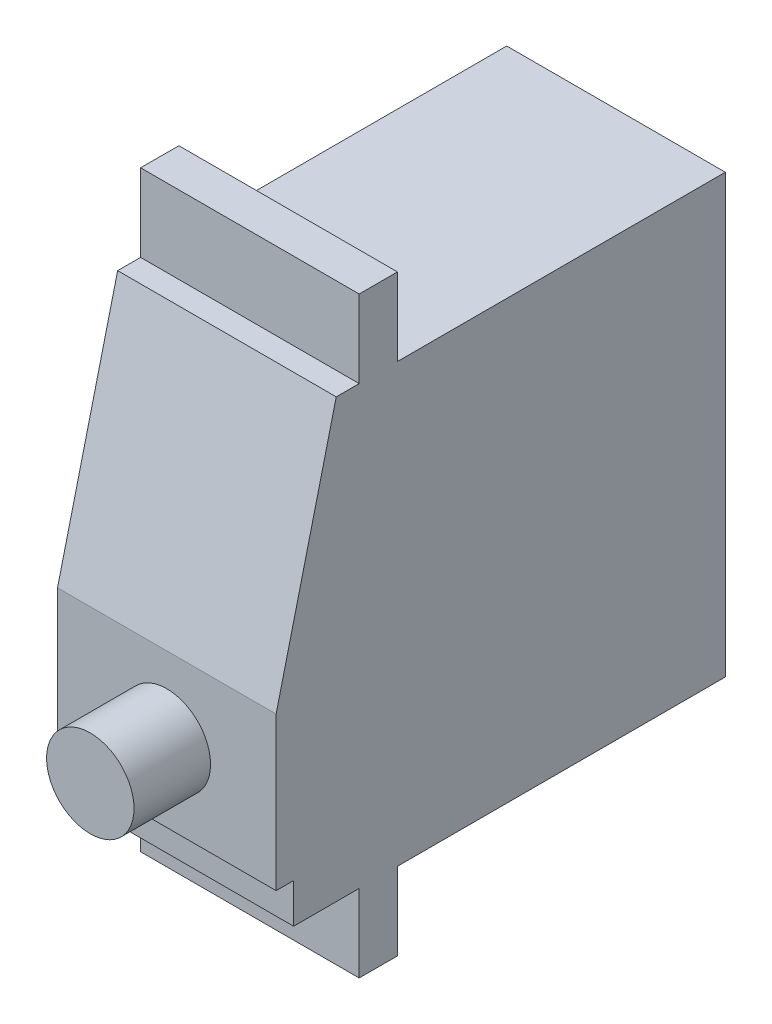
ISO-10303-21;
HEADER;
FILE_DESCRIPTION(('STEP AP214'),'2;1');
FILE_NAME('part.step','',(''),(''),'','','');
FILE_SCHEMA(('AUTOMOTIVE_DESIGN { 1 0 10303 214 1 1 1 1 }'));
ENDSEC;
DATA;
#1=APPLICATION_CONTEXT('core data for automotive mechanical design processes');
#2=APPLICATION_PROTOCOL_DEFINITION('international standard','automotive_design',2000,#1);
#3=PRODUCT_CONTEXT('',#1,'mechanical');
#4=PRODUCT('Part','Part','',(#3));
#5=PRODUCT_RELATED_PRODUCT_CATEGORY('part','',(#4));
#6=PRODUCT_DEFINITION_FORMATION('','',#4);
#7=PRODUCT_DEFINITION_CONTEXT('part definition',#1,'design');
#8=PRODUCT_DEFINITION('design','',#6,#7);
#9=PRODUCT_DEFINITION_SHAPE('','',#8);
#10=(LENGTH_UNIT() NAMED_UNIT(*) SI_UNIT(.MILLI.,.METRE.));
#11=(NAMED_UNIT(*) PLANE_ANGLE_UNIT() SI_UNIT($,.RADIAN.));
#12=(NAMED_UNIT(*) SI_UNIT($,.STERADIAN.) SOLID_ANGLE_UNIT());
#13=UNCERTAINTY_MEASURE_WITH_UNIT(LENGTH_MEASURE(1.E-05),#10,'distance_accuracy_value','');
#14=(GEOMETRIC_REPRESENTATION_CONTEXT(3) GLOBAL_UNCERTAINTY_ASSIGNED_CONTEXT((#13)) GLOBAL_UNIT_ASSIGNED_CONTEXT((#10,
#11,#12)) REPRESENTATION_CONTEXT('',''));
#15=CARTESIAN_POINT('',(0.,0.,0.));
#16=DIRECTION('',(0.,0.,1.));
#17=DIRECTION('',(1.,0.,0.));
#18=AXIS2_PLACEMENT_3D('',#15,#16,#17);
#19=CARTESIAN_POINT('',(-9.99999955296516,29.3791089206934,0.));
#20=DIRECTION('',(0.,1.,0.));
#21=DIRECTION('',(0.,0.,1.));
#22=AXIS2_PLACEMENT_3D('',#19,#20,#21);
#23=PLANE('',#22);
#24=DIRECTION('',(0.,0.,1.));
#25=VECTOR('',#24,1.);
#26=CARTESIAN_POINT('',(-9.99999955296516,29.3791089206934,0.));
#27=LINE('',#26,#25);
#28=CARTESIAN_POINT('',(-9.99999955296516,29.3791089206934,0.));
#29=VERTEX_POINT('',#28);
#30=CARTESIAN_POINT('',(-9.99999955296518,29.3791089206934,32.225966149538));
#31=VERTEX_POINT('',#30);
#32=EDGE_CURVE('E170',#29,#31,#27,.T.);
#33=ORIENTED_EDGE('',*,*,#32,.T.);
#34=DIRECTION('',(0.00392855270652036,0.,-0.999992283207042));
#35=VECTOR('',#34,1.);
#36=CARTESIAN_POINT('',(-10.0051267672293,29.3791089206934,33.5310713833168));
#37=LINE('',#36,#35);
#38=CARTESIAN_POINT('',(-9.99125465750694,29.3791089206934,29.9999993294477));
#39=VERTEX_POINT('',#38);
#40=EDGE_CURVE('E153',#31,#39,#37,.T.);
#41=ORIENTED_EDGE('',*,*,#40,.T.);
#42=DIRECTION('',(1.,0.,0.));
#43=VECTOR('',#42,1.);
#44=CARTESIAN_POINT('',(-17.9139704070891,29.3791089206934,29.9999993294477));
#45=LINE('',#44,#43);
#46=CARTESIAN_POINT('',(10.,29.3791089206934,29.9999993294477));
#47=VERTEX_POINT('',#46);
#48=EDGE_CURVE('E159',#39,#47,#45,.T.);
#49=ORIENTED_EDGE('',*,*,#48,.T.);
#50=DIRECTION('',(0.,0.,1.));
#51=VECTOR('',#50,1.);
#52=CARTESIAN_POINT('',(10.,29.3791089206934,0.));
#53=LINE('',#52,#51);
#54=CARTESIAN_POINT('',(10.,29.3791089206934,0.));
#55=VERTEX_POINT('',#54);
#56=EDGE_CURVE('E234',#55,#47,#53,.T.);
#57=ORIENTED_EDGE('',*,*,#56,.F.);
#58=DIRECTION('',(1.,0.,0.));
#59=VECTOR('',#58,1.);
#60=CARTESIAN_POINT('',(-9.99999955296516,29.3791089206934,0.));
#61=LINE('',#60,#59);
#62=EDGE_CURVE('E239',#29,#55,#61,.T.);
#63=ORIENTED_EDGE('',*,*,#62,.F.);
#64=EDGE_LOOP('',(#33,#41,#49,#57,#63));
#65=FACE_BOUND('',#64,.T.);
#66=ADVANCED_FACE('F35',(#65),#23,.T.);
#67=CARTESIAN_POINT('',(-9.99999955296516,-17.720889300108,0.));
#68=DIRECTION('',(0.,0.,-1.));
#69=DIRECTION('',(0.,1.,0.));
#70=AXIS2_PLACEMENT_3D('',#67,#68,#69);
#71=PLANE('',#70);
#72=DIRECTION('',(1.,0.,0.));
#73=VECTOR('',#72,1.);
#74=CARTESIAN_POINT('',(-9.99999955296516,-10.6208901852369,0.));
#75=LINE('',#74,#73);
#76=CARTESIAN_POINT('',(-9.99999955296516,-10.6208901852369,0.));
#77=VERTEX_POINT('',#76);
#78=CARTESIAN_POINT('',(10.,-10.6208901852369,0.));
#79=VERTEX_POINT('',#78);
#80=EDGE_CURVE('E256',#77,#79,#75,.T.);
#81=ORIENTED_EDGE('',*,*,#80,.F.);
#82=DIRECTION('',(0.,1.,0.));
#83=VECTOR('',#82,1.);
#84=CARTESIAN_POINT('',(-9.99999955296516,-17.720889300108,0.));
#85=LINE('',#84,#83);
#86=EDGE_CURVE('E232',#77,#29,#85,.T.);
#87=ORIENTED_EDGE('',*,*,#86,.T.);
#88=ORIENTED_EDGE('',*,*,#62,.T.);
#89=DIRECTION('',(0.,1.,0.));
#90=VECTOR('',#89,1.);
#91=CARTESIAN_POINT('',(10.,-17.720889300108,0.));
#92=LINE('',#91,#90);
#93=EDGE_CURVE('E254',#79,#55,#92,.T.);
#94=ORIENTED_EDGE('',*,*,#93,.F.);
#95=EDGE_LOOP('',(#81,#87,#88,#94));
#96=FACE_BOUND('',#95,.T.);
#97=ADVANCED_FACE('F334',(#96),#71,.T.);
#98=CARTESIAN_POINT('',(-9.99999955296516,-17.720889300108,41.0999990999699));
#99=DIRECTION('',(0.,-1.,0.));
#100=DIRECTION('',(0.,0.,-1.));
#101=AXIS2_PLACEMENT_3D('',#98,#99,#100);
#102=PLANE('',#101);
#103=DIRECTION('',(1.,0.,0.));
#104=VECTOR('',#103,1.);
#105=CARTESIAN_POINT('',(-9.99999955296516,-17.720889300108,33.500000834465));
#106=LINE('',#105,#104);
#107=CARTESIAN_POINT('',(-9.99999955296516,-17.720889300108,33.500000834465));
#108=VERTEX_POINT('',#107);
#109=CARTESIAN_POINT('',(10.,-17.720889300108,33.500000834465));
#110=VERTEX_POINT('',#109);
#111=EDGE_CURVE('E290',#108,#110,#106,.T.);
#112=ORIENTED_EDGE('',*,*,#111,.F.);
#113=DIRECTION('',(0.,0.,-1.));
#114=VECTOR('',#113,1.);
#115=CARTESIAN_POINT('',(-9.99999955296516,-17.720889300108,41.0999990999699));
#116=LINE('',#115,#114);
#117=CARTESIAN_POINT('',(-9.99999955296516,-17.720889300108,29.9999993294477));
#118=VERTEX_POINT('',#117);
#119=EDGE_CURVE('E241',#108,#118,#116,.T.);
#120=ORIENTED_EDGE('',*,*,#119,.T.);
#121=DIRECTION('',(1.,0.,0.));
#122=VECTOR('',#121,1.);
#123=CARTESIAN_POINT('',(-9.99999955296516,-17.720889300108,29.9999993294477));
#124=LINE('',#123,#122);
#125=CARTESIAN_POINT('',(10.,-17.720889300108,29.9999993294477));
#126=VERTEX_POINT('',#125);
#127=EDGE_CURVE('E307',#118,#126,#124,.T.);
#128=ORIENTED_EDGE('',*,*,#127,.T.);
#129=DIRECTION('',(0.,0.,-1.));
#130=VECTOR('',#129,1.);
#131=CARTESIAN_POINT('',(10.,-17.720889300108,41.0999990999699));
#132=LINE('',#131,#130);
#133=EDGE_CURVE('E230',#110,#126,#132,.T.);
#134=ORIENTED_EDGE('',*,*,#133,.F.);
#135=EDGE_LOOP('',(#112,#120,#128,#134));
#136=FACE_BOUND('',#135,.T.);
#137=ADVANCED_FACE('F207',(#136),#102,.T.);
#138=CARTESIAN_POINT('',(-9.99999955296516,7.00000021606684,41.0999990999699));
#139=DIRECTION('',(0.,0.,1.));
#140=DIRECTION('',(1.,0.,0.));
#141=AXIS2_PLACEMENT_3D('',#138,#139,#140);
#142=PLANE('',#141);
#143=CARTESIAN_POINT('',(0.,0.,41.0999990999699));
#144=DIRECTION('',(0.,0.,1.));
#145=DIRECTION('',(1.,0.,0.));
#146=AXIS2_PLACEMENT_3D('',#143,#144,#145);
#147=CIRCLE('',#146,4.);
#148=CARTESIAN_POINT('',(4.,0.,41.0999990999699));
#149=VERTEX_POINT('',#148);
#150=EDGE_CURVE('E12',#149,#149,#147,.T.);
#151=ORIENTED_EDGE('',*,*,#150,.F.);
#152=EDGE_LOOP('',(#151));
#153=FACE_BOUND('',#152,.T.);
#154=DIRECTION('',(1.,0.,0.));
#155=VECTOR('',#154,1.);
#156=CARTESIAN_POINT('',(-9.99999955296516,-7.00000021606684,41.0999990999699));
#157=LINE('',#156,#155);
#158=CARTESIAN_POINT('',(-9.99999955296516,-7.00000021606684,41.0999990999699));
#159=VERTEX_POINT('',#158);
#160=CARTESIAN_POINT('',(10.,-7.00000021606684,41.0999990999699));
#161=VERTEX_POINT('',#160);
#162=EDGE_CURVE('E212',#159,#161,#157,.T.);
#163=ORIENTED_EDGE('',*,*,#162,.T.);
#164=DIRECTION('',(0.,-1.,0.));
#165=VECTOR('',#164,1.);
#166=CARTESIAN_POINT('',(10.,7.00000021606684,41.0999990999699));
#167=LINE('',#166,#165);
#168=CARTESIAN_POINT('',(10.,7.00000021606684,41.0999990999699));
#169=VERTEX_POINT('',#168);
#170=EDGE_CURVE('E214',#169,#161,#167,.T.);
#171=ORIENTED_EDGE('',*,*,#170,.F.);
#172=DIRECTION('',(1.,0.,0.));
#173=VECTOR('',#172,1.);
#174=CARTESIAN_POINT('',(-9.99999955296516,7.00000021606684,41.0999990999699));
#175=LINE('',#174,#173);
#176=CARTESIAN_POINT('',(-9.99999955296516,7.00000021606684,41.0999990999699));
#177=VERTEX_POINT('',#176);
#178=EDGE_CURVE('E171',#177,#169,#175,.T.);
#179=ORIENTED_EDGE('',*,*,#178,.F.);
#180=DIRECTION('',(0.,-1.,0.));
#181=VECTOR('',#180,1.);
#182=CARTESIAN_POINT('',(-9.99999955296516,7.00000021606684,41.0999990999699));
#183=LINE('',#182,#181);
#184=EDGE_CURVE('E217',#177,#159,#183,.T.);
#185=ORIENTED_EDGE('',*,*,#184,.T.);
#186=EDGE_LOOP('',(#163,#171,#179,#185));
#187=FACE_BOUND('',#186,.T.);
#188=ADVANCED_FACE('F203',(#153,#187),#142,.T.);
#189=CARTESIAN_POINT('',(-9.99999955296516,29.3791089206934,35.5999991297722));
#190=DIRECTION('',(0.,0.23866292569632,0.971102470338776));
#191=DIRECTION('',(0.,-0.971102470338776,0.23866292569632));
#192=AXIS2_PLACEMENT_3D('',#189,#190,#191);
#193=PLANE('',#192);
#194=DIRECTION('',(0.,-0.971102470338776,0.23866292569632));
#195=VECTOR('',#194,1.);
#196=CARTESIAN_POINT('',(10.,29.3791089206934,35.5999991297722));
#197=LINE('',#196,#195);
#198=CARTESIAN_POINT('',(10.,29.3791089206934,35.5999991297722));
#199=VERTEX_POINT('',#198);
#200=EDGE_CURVE('E229',#199,#169,#197,.T.);
#201=ORIENTED_EDGE('',*,*,#200,.F.);
#202=DIRECTION('',(1.,0.,0.));
#203=VECTOR('',#202,1.);
#204=CARTESIAN_POINT('',(-9.99999955296516,29.3791089206934,35.5999991297722));
#205=LINE('',#204,#203);
#206=CARTESIAN_POINT('',(-9.99999955296516,29.3791089206934,35.5999991297722));
#207=VERTEX_POINT('',#206);
#208=EDGE_CURVE('E175',#207,#199,#205,.T.);
#209=ORIENTED_EDGE('',*,*,#208,.F.);
#210=DIRECTION('',(0.,-0.971102470338776,0.23866292569632));
#211=VECTOR('',#210,1.);
#212=CARTESIAN_POINT('',(-9.99999955296516,29.3791089206934,35.5999991297722));
#213=LINE('',#212,#211);
#214=EDGE_CURVE('E250',#207,#177,#213,.T.);
#215=ORIENTED_EDGE('',*,*,#214,.T.);
#216=ORIENTED_EDGE('',*,*,#178,.T.);
#217=EDGE_LOOP('',(#201,#209,#215,#216));
#218=FACE_BOUND('',#217,.T.);
#219=ADVANCED_FACE('F206',(#218),#193,.T.);
#220=DIRECTION('',(1.,0.,0.));
#221=VECTOR('',#220,1.);
#222=CARTESIAN_POINT('',(-17.9139704070891,29.3791089206934,33.500000834465));
#223=LINE('',#222,#221);
#224=CARTESIAN_POINT('',(-9.99999955296516,29.3791089206934,33.500000834465));
#225=VERTEX_POINT('',#224);
#226=CARTESIAN_POINT('',(10.,29.3791089206934,33.500000834465));
#227=VERTEX_POINT('',#226);
#228=EDGE_CURVE('E44',#225,#227,#223,.T.);
#229=ORIENTED_EDGE('',*,*,#228,.F.);
#230=EDGE_CURVE('E262',#225,#207,#27,.T.);
#231=ORIENTED_EDGE('',*,*,#230,.T.);
#232=ORIENTED_EDGE('',*,*,#208,.T.);
#233=EDGE_CURVE('E255',#227,#199,#53,.T.);
#234=ORIENTED_EDGE('',*,*,#233,.F.);
#235=EDGE_LOOP('',(#229,#231,#232,#234));
#236=FACE_BOUND('',#235,.T.);
#237=ADVANCED_FACE('F260',(#236),#23,.T.);
#238=CARTESIAN_POINT('',(-9.99999955296516,0.,0.));
#239=DIRECTION('',(1.,0.,0.));
#240=DIRECTION('',(0.,0.,-1.));
#241=AXIS2_PLACEMENT_3D('',#238,#239,#240);
#242=PLANE('',#241);
#243=DIRECTION('',(0.,0.,1.));
#244=VECTOR('',#243,1.);
#245=CARTESIAN_POINT('',(-9.99999955296516,-10.6208901852369,33.500000834465));
#246=LINE('',#245,#244);
#247=CARTESIAN_POINT('',(-9.99999955296516,-10.6208901852369,33.500000834465));
#248=VERTEX_POINT('',#247);
#249=CARTESIAN_POINT('',(-9.99999955296516,-10.6208901852369,39.5000018179417));
#250=VERTEX_POINT('',#249);
#251=EDGE_CURVE('E283',#248,#250,#246,.T.);
#252=ORIENTED_EDGE('',*,*,#251,.T.);
#253=DIRECTION('',(0.,1.,0.));
#254=VECTOR('',#253,1.);
#255=CARTESIAN_POINT('',(-9.99999955296516,-10.6208901852369,39.5000018179417));
#256=LINE('',#255,#254);
#257=CARTESIAN_POINT('',(-9.99999955296516,-7.00000021606684,39.5000018179417));
#258=VERTEX_POINT('',#257);
#259=EDGE_CURVE('E60',#250,#258,#256,.T.);
#260=ORIENTED_EDGE('',*,*,#259,.T.);
#261=DIRECTION('',(0.,0.,1.));
#262=VECTOR('',#261,1.);
#263=CARTESIAN_POINT('',(-9.99999955296516,-7.00000021606684,39.5000018179417));
#264=LINE('',#263,#262);
#265=EDGE_CURVE('E269',#258,#159,#264,.T.);
#266=ORIENTED_EDGE('',*,*,#265,.T.);
#267=ORIENTED_EDGE('',*,*,#184,.F.);
#268=ORIENTED_EDGE('',*,*,#214,.F.);
#269=ORIENTED_EDGE('',*,*,#230,.F.);
#270=EDGE_CURVE('E312',#31,#225,#27,.T.);
#271=ORIENTED_EDGE('',*,*,#270,.F.);
#272=ORIENTED_EDGE('',*,*,#32,.F.);
#273=ORIENTED_EDGE('',*,*,#86,.F.);
#274=DIRECTION('',(0.,0.,1.));
#275=VECTOR('',#274,1.);
#276=CARTESIAN_POINT('',(-9.99999955296516,-10.6208901852369,0.));
#277=LINE('',#276,#275);
#278=CARTESIAN_POINT('',(-9.99999955296516,-10.6208901852369,29.9999993294477));
#279=VERTEX_POINT('',#278);
#280=EDGE_CURVE('E295',#77,#279,#277,.T.);
#281=ORIENTED_EDGE('',*,*,#280,.T.);
#282=DIRECTION('',(0.,-1.,0.));
#283=VECTOR('',#282,1.);
#284=CARTESIAN_POINT('',(-9.99999955296516,-10.6208901852369,29.9999993294477));
#285=LINE('',#284,#283);
#286=EDGE_CURVE('E298',#279,#118,#285,.T.);
#287=ORIENTED_EDGE('',*,*,#286,.T.);
#288=ORIENTED_EDGE('',*,*,#119,.F.);
#289=DIRECTION('',(0.,1.,0.));
#290=VECTOR('',#289,1.);
#291=CARTESIAN_POINT('',(-9.99999955296516,-17.720889300108,33.500000834465));
#292=LINE('',#291,#290);
#293=EDGE_CURVE('E280',#108,#248,#292,.T.);
#294=ORIENTED_EDGE('',*,*,#293,.T.);
#295=EDGE_LOOP('',(#252,#260,#266,#267,#268,#269,#271,#272,#273,#281,#287,#288,#294));
#296=FACE_BOUND('',#295,.T.);
#297=ADVANCED_FACE('F268',(#296),#242,.F.);
#298=CARTESIAN_POINT('',(10.,0.,0.));
#299=DIRECTION('',(1.,0.,0.));
#300=DIRECTION('',(0.,0.,-1.));
#301=AXIS2_PLACEMENT_3D('',#298,#299,#300);
#302=PLANE('',#301);
#303=DIRECTION('',(0.,1.,0.));
#304=VECTOR('',#303,1.);
#305=CARTESIAN_POINT('',(10.,-10.6208901852369,39.5000018179417));
#306=LINE('',#305,#304);
#307=CARTESIAN_POINT('',(10.,-10.6208901852369,39.5000018179417));
#308=VERTEX_POINT('',#307);
#309=CARTESIAN_POINT('',(10.,-7.00000021606684,39.5000018179417));
#310=VERTEX_POINT('',#309);
#311=EDGE_CURVE('E274',#308,#310,#306,.T.);
#312=ORIENTED_EDGE('',*,*,#311,.F.);
#313=DIRECTION('',(0.,0.,1.));
#314=VECTOR('',#313,1.);
#315=CARTESIAN_POINT('',(10.,-10.6208901852369,33.500000834465));
#316=LINE('',#315,#314);
#317=CARTESIAN_POINT('',(10.,-10.6208901852369,33.500000834465));
#318=VERTEX_POINT('',#317);
#319=EDGE_CURVE('E284',#318,#308,#316,.T.);
#320=ORIENTED_EDGE('',*,*,#319,.F.);
#321=DIRECTION('',(0.,1.,0.));
#322=VECTOR('',#321,1.);
#323=CARTESIAN_POINT('',(10.,-17.720889300108,33.500000834465));
#324=LINE('',#323,#322);
#325=EDGE_CURVE('E278',#110,#318,#324,.T.);
#326=ORIENTED_EDGE('',*,*,#325,.F.);
#327=ORIENTED_EDGE('',*,*,#133,.T.);
#328=DIRECTION('',(0.,-1.,0.));
#329=VECTOR('',#328,1.);
#330=CARTESIAN_POINT('',(10.,-10.6208901852369,29.9999993294477));
#331=LINE('',#330,#329);
#332=CARTESIAN_POINT('',(10.,-10.6208901852369,29.9999993294477));
#333=VERTEX_POINT('',#332);
#334=EDGE_CURVE('E299',#333,#126,#331,.T.);
#335=ORIENTED_EDGE('',*,*,#334,.F.);
#336=DIRECTION('',(0.,0.,1.));
#337=VECTOR('',#336,1.);
#338=CARTESIAN_POINT('',(10.,-10.6208901852369,0.));
#339=LINE('',#338,#337);
#340=EDGE_CURVE('E292',#79,#333,#339,.T.);
#341=ORIENTED_EDGE('',*,*,#340,.F.);
#342=ORIENTED_EDGE('',*,*,#93,.T.);
#343=ORIENTED_EDGE('',*,*,#56,.T.);
#344=DIRECTION('',(0.,1.,0.));
#345=VECTOR('',#344,1.);
#346=CARTESIAN_POINT('',(10.,29.3791089206934,29.9999993294477));
#347=LINE('',#346,#345);
#348=CARTESIAN_POINT('',(10.,36.4791117608547,29.9999993294477));
#349=VERTEX_POINT('',#348);
#350=EDGE_CURVE('E52',#47,#349,#347,.T.);
#351=ORIENTED_EDGE('',*,*,#350,.T.);
#352=DIRECTION('',(0.,0.,1.));
#353=VECTOR('',#352,1.);
#354=CARTESIAN_POINT('',(10.,36.4791117608547,29.9999993294477));
#355=LINE('',#354,#353);
#356=CARTESIAN_POINT('',(10.,36.4791117608547,33.500000834465));
#357=VERTEX_POINT('',#356);
#358=EDGE_CURVE('E179',#349,#357,#355,.T.);
#359=ORIENTED_EDGE('',*,*,#358,.T.);
#360=DIRECTION('',(0.,-1.,0.));
#361=VECTOR('',#360,1.);
#362=CARTESIAN_POINT('',(10.,36.4791117608547,33.500000834465));
#363=LINE('',#362,#361);
#364=EDGE_CURVE('E188',#357,#227,#363,.T.);
#365=ORIENTED_EDGE('',*,*,#364,.T.);
#366=ORIENTED_EDGE('',*,*,#233,.T.);
#367=ORIENTED_EDGE('',*,*,#200,.T.);
#368=ORIENTED_EDGE('',*,*,#170,.T.);
#369=DIRECTION('',(0.,0.,1.));
#370=VECTOR('',#369,1.);
#371=CARTESIAN_POINT('',(10.,-7.00000021606684,39.5000018179417));
#372=LINE('',#371,#370);
#373=EDGE_CURVE('E227',#310,#161,#372,.T.);
#374=ORIENTED_EDGE('',*,*,#373,.F.);
#375=EDGE_LOOP('',(#312,#320,#326,#327,#335,#341,#342,#343,#351,#359,#365,#366,#367,#368,#374));
#376=FACE_BOUND('',#375,.T.);
#377=ADVANCED_FACE('F226',(#376),#302,.T.);
#378=CARTESIAN_POINT('',(-9.99999955296516,-10.6208901852369,0.));
#379=DIRECTION('',(0.,1.,0.));
#380=DIRECTION('',(0.,0.,1.));
#381=AXIS2_PLACEMENT_3D('',#378,#379,#380);
#382=PLANE('',#381);
#383=ORIENTED_EDGE('',*,*,#340,.T.);
#384=DIRECTION('',(1.,0.,0.));
#385=VECTOR('',#384,1.);
#386=CARTESIAN_POINT('',(-9.99999955296516,-10.6208901852369,29.9999993294477));
#387=LINE('',#386,#385);
#388=EDGE_CURVE('E302',#279,#333,#387,.T.);
#389=ORIENTED_EDGE('',*,*,#388,.F.);
#390=ORIENTED_EDGE('',*,*,#280,.F.);
#391=ORIENTED_EDGE('',*,*,#80,.T.);
#392=EDGE_LOOP('',(#383,#389,#390,#391));
#393=FACE_BOUND('',#392,.T.);
#394=ADVANCED_FACE('F352',(#393),#382,.F.);
#395=CARTESIAN_POINT('',(-9.99999955296516,-10.6208901852369,29.9999993294477));
#396=DIRECTION('',(0.,0.,1.));
#397=DIRECTION('',(1.,0.,0.));
#398=AXIS2_PLACEMENT_3D('',#395,#396,#397);
#399=PLANE('',#398);
#400=ORIENTED_EDGE('',*,*,#334,.T.);
#401=ORIENTED_EDGE('',*,*,#127,.F.);
#402=ORIENTED_EDGE('',*,*,#286,.F.);
#403=ORIENTED_EDGE('',*,*,#388,.T.);
#404=EDGE_LOOP('',(#400,#401,#402,#403));
#405=FACE_BOUND('',#404,.T.);
#406=ADVANCED_FACE('F356',(#405),#399,.F.);
#407=CARTESIAN_POINT('',(-9.99999955296516,-17.720889300108,33.500000834465));
#408=DIRECTION('',(0.,0.,-1.));
#409=DIRECTION('',(-1.,0.,0.));
#410=AXIS2_PLACEMENT_3D('',#407,#408,#409);
#411=PLANE('',#410);
#412=ORIENTED_EDGE('',*,*,#325,.T.);
#413=DIRECTION('',(1.,0.,0.));
#414=VECTOR('',#413,1.);
#415=CARTESIAN_POINT('',(-9.99999955296516,-10.6208901852369,33.500000834465));
#416=LINE('',#415,#414);
#417=EDGE_CURVE('E286',#248,#318,#416,.T.);
#418=ORIENTED_EDGE('',*,*,#417,.F.);
#419=ORIENTED_EDGE('',*,*,#293,.F.);
#420=ORIENTED_EDGE('',*,*,#111,.T.);
#421=EDGE_LOOP('',(#412,#418,#419,#420));
#422=FACE_BOUND('',#421,.T.);
#423=ADVANCED_FACE('F360',(#422),#411,.F.);
#424=CARTESIAN_POINT('',(-9.99999955296516,-10.6208901852369,33.500000834465));
#425=DIRECTION('',(0.,1.,0.));
#426=DIRECTION('',(0.,0.,1.));
#427=AXIS2_PLACEMENT_3D('',#424,#425,#426);
#428=PLANE('',#427);
#429=ORIENTED_EDGE('',*,*,#319,.T.);
#430=DIRECTION('',(1.,0.,0.));
#431=VECTOR('',#430,1.);
#432=CARTESIAN_POINT('',(-9.99999955296516,-10.6208901852369,39.5000018179417));
#433=LINE('',#432,#431);
#434=EDGE_CURVE('E221',#250,#308,#433,.T.);
#435=ORIENTED_EDGE('',*,*,#434,.F.);
#436=ORIENTED_EDGE('',*,*,#251,.F.);
#437=ORIENTED_EDGE('',*,*,#417,.T.);
#438=EDGE_LOOP('',(#429,#435,#436,#437));
#439=FACE_BOUND('',#438,.T.);
#440=ADVANCED_FACE('F364',(#439),#428,.F.);
#441=CARTESIAN_POINT('',(-9.99999955296516,-10.6208901852369,39.5000018179417));
#442=DIRECTION('',(0.,0.,-1.));
#443=DIRECTION('',(-1.,0.,0.));
#444=AXIS2_PLACEMENT_3D('',#441,#442,#443);
#445=PLANE('',#444);
#446=ORIENTED_EDGE('',*,*,#311,.T.);
#447=DIRECTION('',(1.,0.,0.));
#448=VECTOR('',#447,1.);
#449=CARTESIAN_POINT('',(-9.99999955296516,-7.00000021606684,39.5000018179417));
#450=LINE('',#449,#448);
#451=EDGE_CURVE('E222',#258,#310,#450,.T.);
#452=ORIENTED_EDGE('',*,*,#451,.F.);
#453=ORIENTED_EDGE('',*,*,#259,.F.);
#454=ORIENTED_EDGE('',*,*,#434,.T.);
#455=EDGE_LOOP('',(#446,#452,#453,#454));
#456=FACE_BOUND('',#455,.T.);
#457=ADVANCED_FACE('F368',(#456),#445,.F.);
#458=CARTESIAN_POINT('',(-9.99999955296516,-7.00000021606684,39.5000018179417));
#459=DIRECTION('',(0.,1.,0.));
#460=DIRECTION('',(0.,0.,1.));
#461=AXIS2_PLACEMENT_3D('',#458,#459,#460);
#462=PLANE('',#461);
#463=ORIENTED_EDGE('',*,*,#373,.T.);
#464=ORIENTED_EDGE('',*,*,#162,.F.);
#465=ORIENTED_EDGE('',*,*,#265,.F.);
#466=ORIENTED_EDGE('',*,*,#451,.T.);
#467=EDGE_LOOP('',(#463,#464,#465,#466));
#468=FACE_BOUND('',#467,.T.);
#469=ADVANCED_FACE('F372',(#468),#462,.F.);
#470=CARTESIAN_POINT('',(-9.87324478812824,0.,-0.0387878618524385));
#471=DIRECTION('',(-0.999992283207042,0.,-0.00392855270652036));
#472=DIRECTION('',(-0.00392855270652036,0.,0.999992283207042));
#473=AXIS2_PLACEMENT_3D('',#470,#471,#472);
#474=PLANE('',#473);
#475=DIRECTION('',(0.,-1.,0.));
#476=VECTOR('',#475,1.);
#477=CARTESIAN_POINT('',(-10.0050047039986,36.4791117608547,33.500000834465));
#478=LINE('',#477,#476);
#479=CARTESIAN_POINT('',(-10.0050047039986,36.4791117608547,33.500000834465));
#480=VERTEX_POINT('',#479);
#481=CARTESIAN_POINT('',(-10.0050047039986,29.3791089206934,33.500000834465));
#482=VERTEX_POINT('',#481);
#483=EDGE_CURVE('E318',#480,#482,#478,.T.);
#484=ORIENTED_EDGE('',*,*,#483,.F.);
#485=DIRECTION('',(-0.00392855270652036,0.,0.999992283207042));
#486=VECTOR('',#485,1.);
#487=CARTESIAN_POINT('',(-9.99137693294937,36.4791117608547,30.0311238956651));
#488=LINE('',#487,#486);
#489=CARTESIAN_POINT('',(-9.99125465750694,36.4791117608547,29.9999993294477));
#490=VERTEX_POINT('',#489);
#491=EDGE_CURVE('E156',#490,#480,#488,.T.);
#492=ORIENTED_EDGE('',*,*,#491,.F.);
#493=DIRECTION('',(0.,1.,0.));
#494=VECTOR('',#493,1.);
#495=CARTESIAN_POINT('',(-9.99125465750694,29.3791089206934,29.9999993294477));
#496=LINE('',#495,#494);
#497=EDGE_CURVE('E150',#39,#490,#496,.T.);
#498=ORIENTED_EDGE('',*,*,#497,.F.);
#499=ORIENTED_EDGE('',*,*,#40,.F.);
#500=EDGE_CURVE('E165',#482,#31,#37,.T.);
#501=ORIENTED_EDGE('',*,*,#500,.F.);
#502=EDGE_LOOP('',(#484,#492,#498,#499,#501));
#503=FACE_BOUND('',#502,.T.);
#504=ADVANCED_FACE('F151',(#503),#474,.T.);
#505=CARTESIAN_POINT('',(-17.9139704070891,29.3791089206934,33.500000834465));
#506=DIRECTION('',(0.,-1.,0.));
#507=DIRECTION('',(0.,0.,-1.));
#508=AXIS2_PLACEMENT_3D('',#505,#506,#507);
#509=PLANE('',#508);
#510=ORIENTED_EDGE('',*,*,#500,.T.);
#511=ORIENTED_EDGE('',*,*,#270,.T.);
#512=EDGE_CURVE('E174',#482,#225,#223,.T.);
#513=ORIENTED_EDGE('',*,*,#512,.F.);
#514=EDGE_LOOP('',(#510,#511,#513));
#515=FACE_BOUND('',#514,.T.);
#516=ADVANCED_FACE('F314',(#515),#509,.T.);
#517=CARTESIAN_POINT('',(-17.9139704070891,29.3791089206934,29.9999993294477));
#518=DIRECTION('',(0.,0.,-1.));
#519=DIRECTION('',(-1.,0.,0.));
#520=AXIS2_PLACEMENT_3D('',#517,#518,#519);
#521=PLANE('',#520);
#522=ORIENTED_EDGE('',*,*,#48,.F.);
#523=ORIENTED_EDGE('',*,*,#497,.T.);
#524=DIRECTION('',(1.,0.,0.));
#525=VECTOR('',#524,1.);
#526=CARTESIAN_POINT('',(-17.9139704070891,36.4791117608547,29.9999993294477));
#527=LINE('',#526,#525);
#528=EDGE_CURVE('E158',#490,#349,#527,.T.);
#529=ORIENTED_EDGE('',*,*,#528,.T.);
#530=ORIENTED_EDGE('',*,*,#350,.F.);
#531=EDGE_LOOP('',(#522,#523,#529,#530));
#532=FACE_BOUND('',#531,.T.);
#533=ADVANCED_FACE('F161',(#532),#521,.T.);
#534=CARTESIAN_POINT('',(-17.9139704070891,36.4791117608547,29.9999993294477));
#535=DIRECTION('',(0.,1.,0.));
#536=DIRECTION('',(0.,0.,1.));
#537=AXIS2_PLACEMENT_3D('',#534,#535,#536);
#538=PLANE('',#537);
#539=ORIENTED_EDGE('',*,*,#528,.F.);
#540=ORIENTED_EDGE('',*,*,#491,.T.);
#541=DIRECTION('',(1.,0.,0.));
#542=VECTOR('',#541,1.);
#543=CARTESIAN_POINT('',(-17.9139704070891,36.4791117608547,33.500000834465));
#544=LINE('',#543,#542);
#545=EDGE_CURVE('E319',#480,#357,#544,.T.);
#546=ORIENTED_EDGE('',*,*,#545,.T.);
#547=ORIENTED_EDGE('',*,*,#358,.F.);
#548=EDGE_LOOP('',(#539,#540,#546,#547));
#549=FACE_BOUND('',#548,.T.);
#550=ADVANCED_FACE('F324',(#549),#538,.T.);
#551=CARTESIAN_POINT('',(-17.9139704070891,36.4791117608547,33.500000834465));
#552=DIRECTION('',(0.,0.,1.));
#553=DIRECTION('',(1.,0.,0.));
#554=AXIS2_PLACEMENT_3D('',#551,#552,#553);
#555=PLANE('',#554);
#556=ORIENTED_EDGE('',*,*,#545,.F.);
#557=ORIENTED_EDGE('',*,*,#483,.T.);
#558=ORIENTED_EDGE('',*,*,#512,.T.);
#559=ORIENTED_EDGE('',*,*,#228,.T.);
#560=ORIENTED_EDGE('',*,*,#364,.F.);
#561=EDGE_LOOP('',(#556,#557,#558,#559,#560));
#562=FACE_BOUND('',#561,.T.);
#563=ADVANCED_FACE('F199',(#562),#555,.T.);
#564=CARTESIAN_POINT('',(0.,0.,48.0999990999699));
#565=DIRECTION('',(0.,0.,-1.));
#566=DIRECTION('',(-1.,0.,0.));
#567=AXIS2_PLACEMENT_3D('',#564,#565,#566);
#568=CYLINDRICAL_SURFACE('',#567,4.);
#569=CARTESIAN_POINT('',(0.,0.,48.0999990999699));
#570=DIRECTION('',(0.,0.,1.));
#571=DIRECTION('',(1.,0.,0.));
#572=AXIS2_PLACEMENT_3D('',#569,#570,#571);
#573=CIRCLE('',#572,4.);
#574=CARTESIAN_POINT('',(4.,0.,48.0999990999699));
#575=VERTEX_POINT('',#574);
#576=EDGE_CURVE('E39',#575,#575,#573,.T.);
#577=ORIENTED_EDGE('',*,*,#576,.F.);
#578=EDGE_LOOP('',(#577));
#579=FACE_BOUND('',#578,.T.);
#580=ORIENTED_EDGE('',*,*,#150,.T.);
#581=EDGE_LOOP('',(#580));
#582=FACE_BOUND('',#581,.T.);
#583=ADVANCED_FACE('F196',(#579,#582),#568,.T.);
#584=CARTESIAN_POINT('',(0.,0.,48.0999990999699));
#585=DIRECTION('',(0.,0.,1.));
#586=DIRECTION('',(1.,0.,0.));
#587=AXIS2_PLACEMENT_3D('',#584,#585,#586);
#588=PLANE('',#587);
#589=ORIENTED_EDGE('',*,*,#576,.T.);
#590=EDGE_LOOP('',(#589));
#591=FACE_BOUND('',#590,.T.);
#592=ADVANCED_FACE('F37',(#591),#588,.T.);
#593=CLOSED_SHELL('',(#66,#97,#137,#188,#219,#237,#297,#377,#394,#406,#423,#440,#457,#469,#504,
#516,#533,#550,#563,#583,#592));
#594=MANIFOLD_SOLID_BREP('B2',#593);
#595=ADVANCED_BREP_SHAPE_REPRESENTATION('',(#18,#594),#14);
#596=SHAPE_DEFINITION_REPRESENTATION(#9,#595);
ENDSEC;
END-ISO-10303-21;
